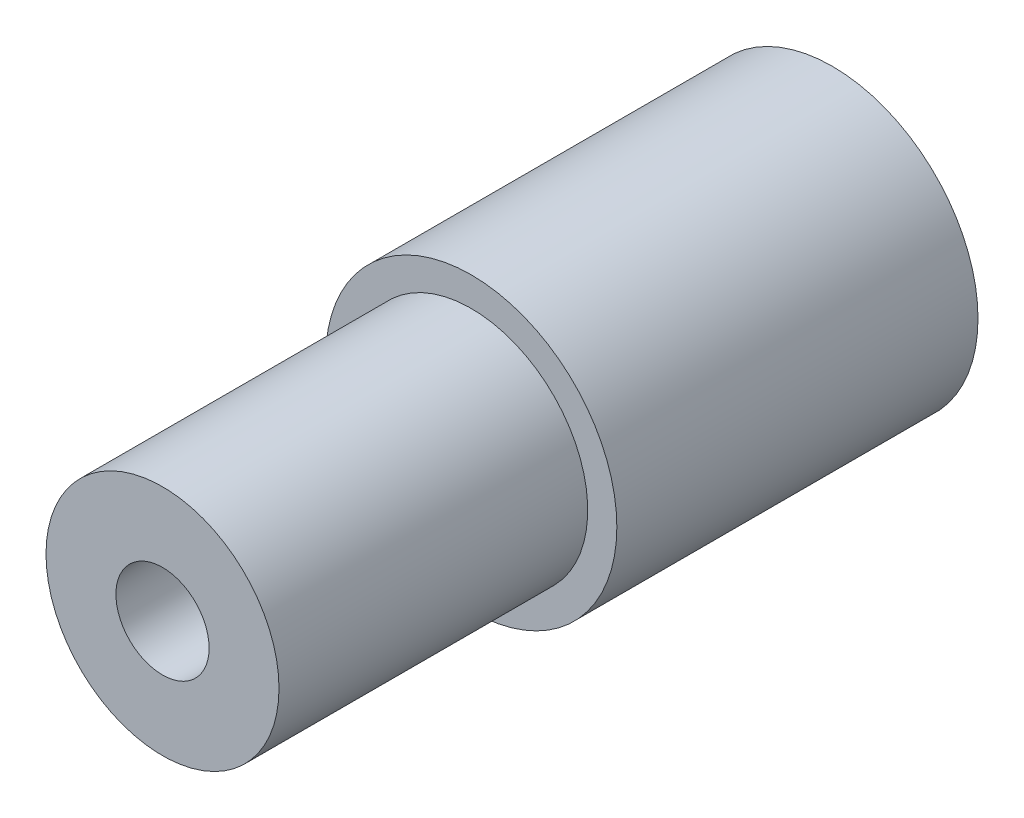
ISO-10303-21;
HEADER;
FILE_DESCRIPTION(('STEP AP214'),'2;1');
FILE_NAME('part.step','',(''),(''),'','','');
FILE_SCHEMA(('AUTOMOTIVE_DESIGN { 1 0 10303 214 1 1 1 1 }'));
ENDSEC;
DATA;
#1=APPLICATION_CONTEXT('core data for automotive mechanical design processes');
#2=APPLICATION_PROTOCOL_DEFINITION('international standard','automotive_design',2000,#1);
#3=PRODUCT_CONTEXT('',#1,'mechanical');
#4=PRODUCT('Part','Part','',(#3));
#5=PRODUCT_RELATED_PRODUCT_CATEGORY('part','',(#4));
#6=PRODUCT_DEFINITION_FORMATION('','',#4);
#7=PRODUCT_DEFINITION_CONTEXT('part definition',#1,'design');
#8=PRODUCT_DEFINITION('design','',#6,#7);
#9=PRODUCT_DEFINITION_SHAPE('','',#8);
#10=(LENGTH_UNIT() NAMED_UNIT(*) SI_UNIT(.MILLI.,.METRE.));
#11=(NAMED_UNIT(*) PLANE_ANGLE_UNIT() SI_UNIT($,.RADIAN.));
#12=(NAMED_UNIT(*) SI_UNIT($,.STERADIAN.) SOLID_ANGLE_UNIT());
#13=UNCERTAINTY_MEASURE_WITH_UNIT(LENGTH_MEASURE(1.E-05),#10,'distance_accuracy_value','');
#14=(GEOMETRIC_REPRESENTATION_CONTEXT(3) GLOBAL_UNCERTAINTY_ASSIGNED_CONTEXT((#13)) GLOBAL_UNIT_ASSIGNED_CONTEXT((#10,
#11,#12)) REPRESENTATION_CONTEXT('',''));
#15=CARTESIAN_POINT('',(0.,0.,0.));
#16=DIRECTION('',(0.,0.,1.));
#17=DIRECTION('',(1.,0.,0.));
#18=AXIS2_PLACEMENT_3D('',#15,#16,#17);
#19=CARTESIAN_POINT('',(0.,0.,23.));
#20=DIRECTION('',(0.,0.,-1.));
#21=DIRECTION('',(-1.,0.,0.));
#22=AXIS2_PLACEMENT_3D('',#19,#20,#21);
#23=CYLINDRICAL_SURFACE('',#22,4.);
#24=CARTESIAN_POINT('',(0.,0.,23.));
#25=DIRECTION('',(0.,0.,1.));
#26=DIRECTION('',(1.,0.,0.));
#27=AXIS2_PLACEMENT_3D('',#24,#25,#26);
#28=CIRCLE('',#27,4.);
#29=CARTESIAN_POINT('',(4.,0.,23.));
#30=VERTEX_POINT('',#29);
#31=EDGE_CURVE('E50',#30,#30,#28,.T.);
#32=ORIENTED_EDGE('',*,*,#31,.F.);
#33=EDGE_LOOP('',(#32));
#34=FACE_BOUND('',#33,.T.);
#35=CARTESIAN_POINT('',(0.,0.,12.4));
#36=DIRECTION('',(0.,0.,-1.));
#37=DIRECTION('',(-1.,0.,0.));
#38=AXIS2_PLACEMENT_3D('',#35,#36,#37);
#39=CIRCLE('',#38,4.);
#40=CARTESIAN_POINT('',(-4.,0.,12.4));
#41=VERTEX_POINT('',#40);
#42=EDGE_CURVE('E12',#41,#41,#39,.T.);
#43=ORIENTED_EDGE('',*,*,#42,.F.);
#44=EDGE_LOOP('',(#43));
#45=FACE_BOUND('',#44,.T.);
#46=ADVANCED_FACE('F44',(#34,#45),#23,.T.);
#47=CARTESIAN_POINT('',(0.,0.,23.));
#48=DIRECTION('',(0.,0.,1.));
#49=DIRECTION('',(1.,0.,0.));
#50=AXIS2_PLACEMENT_3D('',#47,#48,#49);
#51=PLANE('',#50);
#52=ORIENTED_EDGE('',*,*,#31,.T.);
#53=EDGE_LOOP('',(#52));
#54=FACE_BOUND('',#53,.T.);
#55=CARTESIAN_POINT('',(0.,0.,23.));
#56=DIRECTION('',(0.,0.,1.));
#57=DIRECTION('',(1.,0.,0.));
#58=AXIS2_PLACEMENT_3D('',#55,#56,#57);
#59=CIRCLE('',#58,1.6);
#60=CARTESIAN_POINT('',(1.6,0.,23.));
#61=VERTEX_POINT('',#60);
#62=EDGE_CURVE('E54',#61,#61,#59,.T.);
#63=ORIENTED_EDGE('',*,*,#62,.F.);
#64=EDGE_LOOP('',(#63));
#65=FACE_BOUND('',#64,.T.);
#66=ADVANCED_FACE('F82',(#54,#65),#51,.T.);
#67=CARTESIAN_POINT('',(0.,0.,0.));
#68=DIRECTION('',(0.,0.,1.));
#69=DIRECTION('',(1.,0.,0.));
#70=AXIS2_PLACEMENT_3D('',#67,#68,#69);
#71=PLANE('',#70);
#72=CARTESIAN_POINT('',(0.,0.,0.));
#73=DIRECTION('',(0.,0.,1.));
#74=DIRECTION('',(1.,0.,0.));
#75=AXIS2_PLACEMENT_3D('',#72,#73,#74);
#76=CIRCLE('',#75,1.6);
#77=CARTESIAN_POINT('',(1.6,0.,0.));
#78=VERTEX_POINT('',#77);
#79=EDGE_CURVE('E58',#78,#78,#76,.T.);
#80=ORIENTED_EDGE('',*,*,#79,.T.);
#81=EDGE_LOOP('',(#80));
#82=FACE_BOUND('',#81,.T.);
#83=CARTESIAN_POINT('',(0.,0.,0.));
#84=DIRECTION('',(0.,0.,-1.));
#85=DIRECTION('',(-1.,0.,0.));
#86=AXIS2_PLACEMENT_3D('',#83,#84,#85);
#87=CIRCLE('',#86,5.);
#88=CARTESIAN_POINT('',(-5.,0.,0.));
#89=VERTEX_POINT('',#88);
#90=EDGE_CURVE('E64',#89,#89,#87,.T.);
#91=ORIENTED_EDGE('',*,*,#90,.T.);
#92=EDGE_LOOP('',(#91));
#93=FACE_BOUND('',#92,.T.);
#94=ADVANCED_FACE('F87',(#82,#93),#71,.F.);
#95=CARTESIAN_POINT('',(0.,0.,23.));
#96=DIRECTION('',(0.,0.,-1.));
#97=DIRECTION('',(-1.,0.,0.));
#98=AXIS2_PLACEMENT_3D('',#95,#96,#97);
#99=CYLINDRICAL_SURFACE('',#98,1.6);
#100=ORIENTED_EDGE('',*,*,#62,.T.);
#101=EDGE_LOOP('',(#100));
#102=FACE_BOUND('',#101,.T.);
#103=ORIENTED_EDGE('',*,*,#79,.F.);
#104=EDGE_LOOP('',(#103));
#105=FACE_BOUND('',#104,.T.);
#106=ADVANCED_FACE('F79',(#102,#105),#99,.F.);
#107=CARTESIAN_POINT('',(0.,0.,12.4));
#108=DIRECTION('',(0.,0.,-1.));
#109=DIRECTION('',(-1.,0.,0.));
#110=AXIS2_PLACEMENT_3D('',#107,#108,#109);
#111=CYLINDRICAL_SURFACE('',#110,5.);
#112=CARTESIAN_POINT('',(0.,0.,12.4));
#113=DIRECTION('',(0.,0.,-1.));
#114=DIRECTION('',(-1.,0.,0.));
#115=AXIS2_PLACEMENT_3D('',#112,#113,#114);
#116=CIRCLE('',#115,5.);
#117=CARTESIAN_POINT('',(-5.,0.,12.4));
#118=VERTEX_POINT('',#117);
#119=EDGE_CURVE('E62',#118,#118,#116,.T.);
#120=ORIENTED_EDGE('',*,*,#119,.T.);
#121=EDGE_LOOP('',(#120));
#122=FACE_BOUND('',#121,.T.);
#123=ORIENTED_EDGE('',*,*,#90,.F.);
#124=EDGE_LOOP('',(#123));
#125=FACE_BOUND('',#124,.T.);
#126=ADVANCED_FACE('F70',(#122,#125),#111,.T.);
#127=CARTESIAN_POINT('',(0.,0.,12.4));
#128=DIRECTION('',(0.,0.,-1.));
#129=DIRECTION('',(-1.,0.,0.));
#130=AXIS2_PLACEMENT_3D('',#127,#128,#129);
#131=PLANE('',#130);
#132=ORIENTED_EDGE('',*,*,#42,.T.);
#133=EDGE_LOOP('',(#132));
#134=FACE_BOUND('',#133,.T.);
#135=ORIENTED_EDGE('',*,*,#119,.F.);
#136=EDGE_LOOP('',(#135));
#137=FACE_BOUND('',#136,.T.);
#138=ADVANCED_FACE('F73',(#134,#137),#131,.F.);
#139=CLOSED_SHELL('',(#46,#66,#94,#106,#126,#138));
#140=MANIFOLD_SOLID_BREP('B2',#139);
#141=ADVANCED_BREP_SHAPE_REPRESENTATION('',(#18,#140),#14);
#142=SHAPE_DEFINITION_REPRESENTATION(#9,#141);
ENDSEC;
END-ISO-10303-21;
